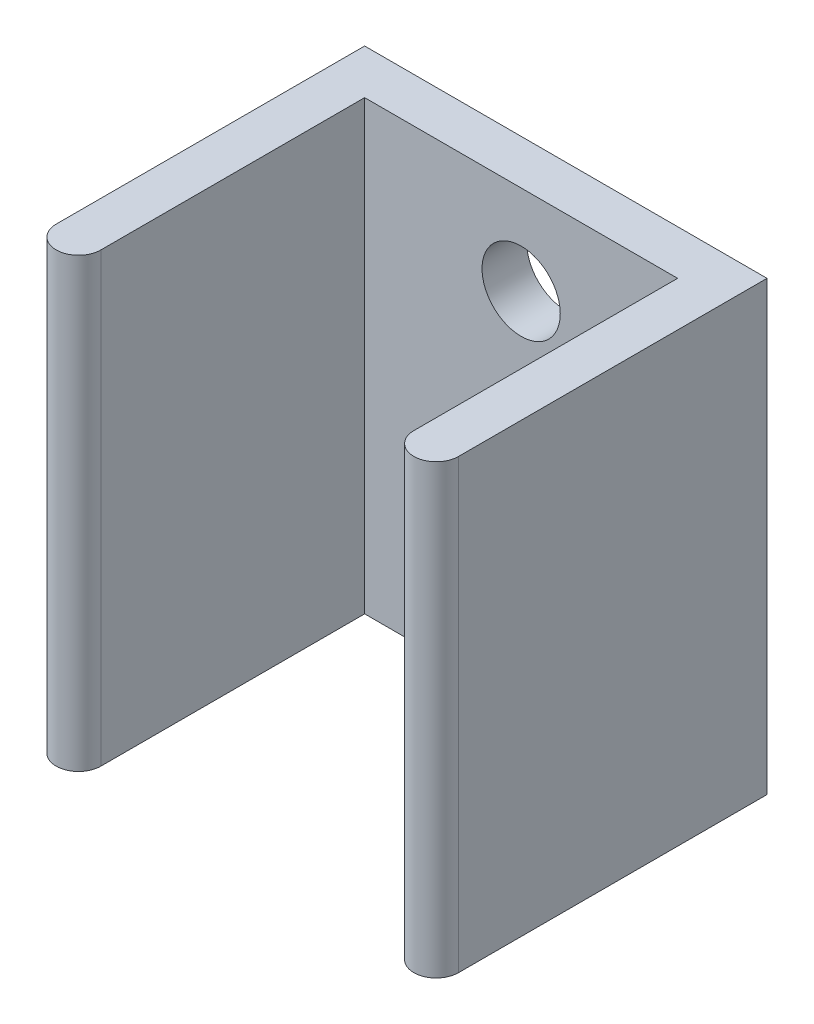
ISO-10303-21;
HEADER;
FILE_DESCRIPTION(('STEP AP214'),'2;1');
FILE_NAME('part.step','',(''),(''),'','','');
FILE_SCHEMA(('AUTOMOTIVE_DESIGN { 1 0 10303 214 1 1 1 1 }'));
ENDSEC;
DATA;
#1=APPLICATION_CONTEXT('core data for automotive mechanical design processes');
#2=APPLICATION_PROTOCOL_DEFINITION('international standard','automotive_design',2000,#1);
#3=PRODUCT_CONTEXT('',#1,'mechanical');
#4=PRODUCT('Part','Part','',(#3));
#5=PRODUCT_RELATED_PRODUCT_CATEGORY('part','',(#4));
#6=PRODUCT_DEFINITION_FORMATION('','',#4);
#7=PRODUCT_DEFINITION_CONTEXT('part definition',#1,'design');
#8=PRODUCT_DEFINITION('design','',#6,#7);
#9=PRODUCT_DEFINITION_SHAPE('','',#8);
#10=(LENGTH_UNIT() NAMED_UNIT(*) SI_UNIT(.MILLI.,.METRE.));
#11=(NAMED_UNIT(*) PLANE_ANGLE_UNIT() SI_UNIT($,.RADIAN.));
#12=(NAMED_UNIT(*) SI_UNIT($,.STERADIAN.) SOLID_ANGLE_UNIT());
#13=UNCERTAINTY_MEASURE_WITH_UNIT(LENGTH_MEASURE(1.E-05),#10,'distance_accuracy_value','');
#14=(GEOMETRIC_REPRESENTATION_CONTEXT(3) GLOBAL_UNCERTAINTY_ASSIGNED_CONTEXT((#13)) GLOBAL_UNIT_ASSIGNED_CONTEXT((#10,
#11,#12)) REPRESENTATION_CONTEXT('',''));
#15=CARTESIAN_POINT('',(0.,0.,0.));
#16=DIRECTION('',(0.,0.,1.));
#17=DIRECTION('',(1.,0.,0.));
#18=AXIS2_PLACEMENT_3D('',#15,#16,#17);
#19=CARTESIAN_POINT('',(8.00000000000001,-10.,13.8));
#20=DIRECTION('',(0.,-1.,0.));
#21=DIRECTION('',(1.,0.,0.));
#22=AXIS2_PLACEMENT_3D('',#19,#20,#21);
#23=CYLINDRICAL_SURFACE('',#22,0.999999999999999);
#24=DIRECTION('',(0.,-1.,0.));
#25=VECTOR('',#24,1.);
#26=CARTESIAN_POINT('',(7.00000000000001,9.99999999999998,13.8));
#27=LINE('',#26,#25);
#28=CARTESIAN_POINT('',(7.00000000000001,-10.,13.8));
#29=VERTEX_POINT('',#28);
#30=CARTESIAN_POINT('',(7.00000000000001,9.99999999999998,13.8));
#31=VERTEX_POINT('',#30);
#32=EDGE_CURVE('E157',#29,#31,#27,.F.);
#33=ORIENTED_EDGE('',*,*,#32,.F.);
#34=CARTESIAN_POINT('',(8.00000000000001,-10.,13.8));
#35=DIRECTION('',(0.,1.,0.));
#36=DIRECTION('',(0.,0.,1.));
#37=AXIS2_PLACEMENT_3D('',#34,#35,#36);
#38=CIRCLE('',#37,0.999999999999999);
#39=CARTESIAN_POINT('',(9.00000000000001,-10.,13.8));
#40=VERTEX_POINT('',#39);
#41=EDGE_CURVE('E43',#40,#29,#38,.F.);
#42=ORIENTED_EDGE('',*,*,#41,.F.);
#43=DIRECTION('',(0.,-1.,0.));
#44=VECTOR('',#43,1.);
#45=CARTESIAN_POINT('',(9.00000000000001,9.99999999999998,13.8));
#46=LINE('',#45,#44);
#47=CARTESIAN_POINT('',(9.00000000000001,9.99999999999998,13.8));
#48=VERTEX_POINT('',#47);
#49=EDGE_CURVE('E160',#48,#40,#46,.T.);
#50=ORIENTED_EDGE('',*,*,#49,.F.);
#51=CARTESIAN_POINT('',(8.00000000000001,9.99999999999998,13.8));
#52=DIRECTION('',(0.,-1.,0.));
#53=DIRECTION('',(0.,0.,-1.));
#54=AXIS2_PLACEMENT_3D('',#51,#52,#53);
#55=CIRCLE('',#54,0.999999999999999);
#56=EDGE_CURVE('E11',#31,#48,#55,.F.);
#57=ORIENTED_EDGE('',*,*,#56,.F.);
#58=EDGE_LOOP('',(#33,#42,#50,#57));
#59=FACE_BOUND('',#58,.T.);
#60=ADVANCED_FACE('F35',(#59),#23,.T.);
#61=CARTESIAN_POINT('',(-7.99999999999999,-10.,13.8));
#62=DIRECTION('',(0.,-1.,0.));
#63=DIRECTION('',(0.,0.,-1.));
#64=AXIS2_PLACEMENT_3D('',#61,#62,#63);
#65=CYLINDRICAL_SURFACE('',#64,1.);
#66=DIRECTION('',(0.,1.,0.));
#67=VECTOR('',#66,1.);
#68=CARTESIAN_POINT('',(-8.99999999999999,-10.,13.8));
#69=LINE('',#68,#67);
#70=CARTESIAN_POINT('',(-8.99999999999999,-10.,13.8));
#71=VERTEX_POINT('',#70);
#72=CARTESIAN_POINT('',(-8.99999999999999,9.99999999999998,13.8));
#73=VERTEX_POINT('',#72);
#74=EDGE_CURVE('E149',#71,#73,#69,.T.);
#75=ORIENTED_EDGE('',*,*,#74,.F.);
#76=CARTESIAN_POINT('',(-7.99999999999999,-10.,13.8));
#77=DIRECTION('',(0.,1.,0.));
#78=DIRECTION('',(0.,0.,1.));
#79=AXIS2_PLACEMENT_3D('',#76,#77,#78);
#80=CIRCLE('',#79,1.);
#81=CARTESIAN_POINT('',(-6.99999999999999,-10.,13.8));
#82=VERTEX_POINT('',#81);
#83=EDGE_CURVE('E154',#82,#71,#80,.F.);
#84=ORIENTED_EDGE('',*,*,#83,.F.);
#85=DIRECTION('',(0.,1.,0.));
#86=VECTOR('',#85,1.);
#87=CARTESIAN_POINT('',(-6.99999999999999,-10.,13.8));
#88=LINE('',#87,#86);
#89=CARTESIAN_POINT('',(-6.99999999999999,9.99999999999998,13.8));
#90=VERTEX_POINT('',#89);
#91=EDGE_CURVE('E152',#90,#82,#88,.F.);
#92=ORIENTED_EDGE('',*,*,#91,.F.);
#93=CARTESIAN_POINT('',(-7.99999999999999,9.99999999999998,13.8));
#94=DIRECTION('',(0.,-1.,0.));
#95=DIRECTION('',(0.,0.,-1.));
#96=AXIS2_PLACEMENT_3D('',#93,#94,#95);
#97=CIRCLE('',#96,1.);
#98=EDGE_CURVE('E101',#73,#90,#97,.F.);
#99=ORIENTED_EDGE('',*,*,#98,.F.);
#100=EDGE_LOOP('',(#75,#84,#92,#99));
#101=FACE_BOUND('',#100,.T.);
#102=ADVANCED_FACE('F195',(#101),#65,.T.);
#103=CARTESIAN_POINT('',(0.,0.,2.));
#104=DIRECTION('',(0.,0.,1.));
#105=DIRECTION('',(1.,0.,0.));
#106=AXIS2_PLACEMENT_3D('',#103,#104,#105);
#107=PLANE('',#106);
#108=CARTESIAN_POINT('',(0.,5.99999999999998,2.));
#109=DIRECTION('',(0.,0.,1.));
#110=DIRECTION('',(1.,0.,0.));
#111=AXIS2_PLACEMENT_3D('',#108,#109,#110);
#112=CIRCLE('',#111,1.75);
#113=CARTESIAN_POINT('',(1.75,5.99999999999998,2.));
#114=VERTEX_POINT('',#113);
#115=EDGE_CURVE('E176',#114,#114,#112,.T.);
#116=ORIENTED_EDGE('',*,*,#115,.F.);
#117=EDGE_LOOP('',(#116));
#118=FACE_BOUND('',#117,.T.);
#119=CARTESIAN_POINT('',(0.,-6.00000000000002,2.));
#120=DIRECTION('',(0.,0.,1.));
#121=DIRECTION('',(1.,0.,0.));
#122=AXIS2_PLACEMENT_3D('',#119,#120,#121);
#123=CIRCLE('',#122,1.75);
#124=CARTESIAN_POINT('',(1.75,-6.00000000000002,2.));
#125=VERTEX_POINT('',#124);
#126=EDGE_CURVE('E170',#125,#125,#123,.T.);
#127=ORIENTED_EDGE('',*,*,#126,.F.);
#128=EDGE_LOOP('',(#127));
#129=FACE_BOUND('',#128,.T.);
#130=DIRECTION('',(1.,0.,0.));
#131=VECTOR('',#130,1.);
#132=CARTESIAN_POINT('',(-8.99999999999999,-10.,2.));
#133=LINE('',#132,#131);
#134=CARTESIAN_POINT('',(-6.99999999999999,-10.,2.));
#135=VERTEX_POINT('',#134);
#136=CARTESIAN_POINT('',(7.00000000000001,-10.,2.));
#137=VERTEX_POINT('',#136);
#138=EDGE_CURVE('E117',#135,#137,#133,.T.);
#139=ORIENTED_EDGE('',*,*,#138,.T.);
#140=DIRECTION('',(0.,-1.,0.));
#141=VECTOR('',#140,1.);
#142=CARTESIAN_POINT('',(7.00000000000001,9.99999999999998,2.));
#143=LINE('',#142,#141);
#144=CARTESIAN_POINT('',(7.00000000000001,9.99999999999998,2.));
#145=VERTEX_POINT('',#144);
#146=EDGE_CURVE('E116',#145,#137,#143,.T.);
#147=ORIENTED_EDGE('',*,*,#146,.F.);
#148=DIRECTION('',(-1.,0.,0.));
#149=VECTOR('',#148,1.);
#150=CARTESIAN_POINT('',(-8.99999999999999,9.99999999999998,2.));
#151=LINE('',#150,#149);
#152=CARTESIAN_POINT('',(-6.99999999999999,9.99999999999998,2.));
#153=VERTEX_POINT('',#152);
#154=EDGE_CURVE('E99',#145,#153,#151,.T.);
#155=ORIENTED_EDGE('',*,*,#154,.T.);
#156=DIRECTION('',(0.,1.,0.));
#157=VECTOR('',#156,1.);
#158=CARTESIAN_POINT('',(-6.99999999999999,9.99999999999998,2.));
#159=LINE('',#158,#157);
#160=EDGE_CURVE('E107',#135,#153,#159,.T.);
#161=ORIENTED_EDGE('',*,*,#160,.F.);
#162=EDGE_LOOP('',(#139,#147,#155,#161));
#163=FACE_BOUND('',#162,.T.);
#164=ADVANCED_FACE('F113',(#118,#129,#163),#107,.T.);
#165=CARTESIAN_POINT('',(9.00000000000001,9.99999999999998,2.));
#166=DIRECTION('',(-1.,0.,0.));
#167=DIRECTION('',(0.,-1.,0.));
#168=AXIS2_PLACEMENT_3D('',#165,#166,#167);
#169=PLANE('',#168);
#170=DIRECTION('',(0.,0.,-1.));
#171=VECTOR('',#170,1.);
#172=CARTESIAN_POINT('',(9.00000000000001,9.99999999999998,2.));
#173=LINE('',#172,#171);
#174=CARTESIAN_POINT('',(9.00000000000001,9.99999999999998,0.));
#175=VERTEX_POINT('',#174);
#176=EDGE_CURVE('E147',#48,#175,#173,.T.);
#177=ORIENTED_EDGE('',*,*,#176,.F.);
#178=ORIENTED_EDGE('',*,*,#49,.T.);
#179=DIRECTION('',(0.,0.,-1.));
#180=VECTOR('',#179,1.);
#181=CARTESIAN_POINT('',(9.00000000000001,-10.,2.));
#182=LINE('',#181,#180);
#183=CARTESIAN_POINT('',(9.00000000000001,-10.,0.));
#184=VERTEX_POINT('',#183);
#185=EDGE_CURVE('E131',#40,#184,#182,.T.);
#186=ORIENTED_EDGE('',*,*,#185,.T.);
#187=DIRECTION('',(0.,1.,0.));
#188=VECTOR('',#187,1.);
#189=CARTESIAN_POINT('',(9.00000000000001,9.99999999999998,0.));
#190=LINE('',#189,#188);
#191=EDGE_CURVE('E128',#184,#175,#190,.T.);
#192=ORIENTED_EDGE('',*,*,#191,.T.);
#193=EDGE_LOOP('',(#177,#178,#186,#192));
#194=FACE_BOUND('',#193,.T.);
#195=ADVANCED_FACE('F194',(#194),#169,.F.);
#196=CARTESIAN_POINT('',(-8.99999999999999,9.99999999999998,2.));
#197=DIRECTION('',(0.,-1.,0.));
#198=DIRECTION('',(0.,0.,-1.));
#199=AXIS2_PLACEMENT_3D('',#196,#197,#198);
#200=PLANE('',#199);
#201=DIRECTION('',(0.,0.,-1.));
#202=VECTOR('',#201,1.);
#203=CARTESIAN_POINT('',(7.00000000000001,9.99999999999998,14.8));
#204=LINE('',#203,#202);
#205=EDGE_CURVE('E122',#31,#145,#204,.T.);
#206=ORIENTED_EDGE('',*,*,#205,.F.);
#207=ORIENTED_EDGE('',*,*,#56,.T.);
#208=ORIENTED_EDGE('',*,*,#176,.T.);
#209=DIRECTION('',(-1.,0.,0.));
#210=VECTOR('',#209,1.);
#211=CARTESIAN_POINT('',(-8.99999999999999,9.99999999999998,0.));
#212=LINE('',#211,#210);
#213=CARTESIAN_POINT('',(-8.99999999999999,9.99999999999998,0.));
#214=VERTEX_POINT('',#213);
#215=EDGE_CURVE('E134',#175,#214,#212,.T.);
#216=ORIENTED_EDGE('',*,*,#215,.T.);
#217=DIRECTION('',(0.,0.,-1.));
#218=VECTOR('',#217,1.);
#219=CARTESIAN_POINT('',(-8.99999999999999,9.99999999999998,2.));
#220=LINE('',#219,#218);
#221=EDGE_CURVE('E145',#73,#214,#220,.T.);
#222=ORIENTED_EDGE('',*,*,#221,.F.);
#223=ORIENTED_EDGE('',*,*,#98,.T.);
#224=DIRECTION('',(0.,0.,-1.));
#225=VECTOR('',#224,1.);
#226=CARTESIAN_POINT('',(-6.99999999999999,9.99999999999998,14.8));
#227=LINE('',#226,#225);
#228=EDGE_CURVE('E96',#90,#153,#227,.T.);
#229=ORIENTED_EDGE('',*,*,#228,.T.);
#230=ORIENTED_EDGE('',*,*,#154,.F.);
#231=EDGE_LOOP('',(#206,#207,#208,#216,#222,#223,#229,#230));
#232=FACE_BOUND('',#231,.T.);
#233=ADVANCED_FACE('F98',(#232),#200,.F.);
#234=CARTESIAN_POINT('',(-8.99999999999999,9.99999999999998,2.));
#235=DIRECTION('',(1.,0.,0.));
#236=DIRECTION('',(0.,1.,0.));
#237=AXIS2_PLACEMENT_3D('',#234,#235,#236);
#238=PLANE('',#237);
#239=DIRECTION('',(0.,0.,-1.));
#240=VECTOR('',#239,1.);
#241=CARTESIAN_POINT('',(-8.99999999999999,-10.,2.));
#242=LINE('',#241,#240);
#243=CARTESIAN_POINT('',(-8.99999999999999,-10.,0.));
#244=VERTEX_POINT('',#243);
#245=EDGE_CURVE('E143',#71,#244,#242,.T.);
#246=ORIENTED_EDGE('',*,*,#245,.F.);
#247=ORIENTED_EDGE('',*,*,#74,.T.);
#248=ORIENTED_EDGE('',*,*,#221,.T.);
#249=DIRECTION('',(0.,-1.,0.));
#250=VECTOR('',#249,1.);
#251=CARTESIAN_POINT('',(-8.99999999999999,9.99999999999998,0.));
#252=LINE('',#251,#250);
#253=EDGE_CURVE('E137',#214,#244,#252,.T.);
#254=ORIENTED_EDGE('',*,*,#253,.T.);
#255=EDGE_LOOP('',(#246,#247,#248,#254));
#256=FACE_BOUND('',#255,.T.);
#257=ADVANCED_FACE('F224',(#256),#238,.F.);
#258=CARTESIAN_POINT('',(-8.99999999999999,-10.,2.));
#259=DIRECTION('',(0.,1.,0.));
#260=DIRECTION('',(0.,0.,1.));
#261=AXIS2_PLACEMENT_3D('',#258,#259,#260);
#262=PLANE('',#261);
#263=ORIENTED_EDGE('',*,*,#185,.F.);
#264=ORIENTED_EDGE('',*,*,#41,.T.);
#265=DIRECTION('',(0.,0.,-1.));
#266=VECTOR('',#265,1.);
#267=CARTESIAN_POINT('',(7.00000000000001,-10.,14.8));
#268=LINE('',#267,#266);
#269=EDGE_CURVE('E124',#29,#137,#268,.T.);
#270=ORIENTED_EDGE('',*,*,#269,.T.);
#271=ORIENTED_EDGE('',*,*,#138,.F.);
#272=DIRECTION('',(0.,0.,-1.));
#273=VECTOR('',#272,1.);
#274=CARTESIAN_POINT('',(-6.99999999999999,-10.,14.8));
#275=LINE('',#274,#273);
#276=EDGE_CURVE('E106',#82,#135,#275,.T.);
#277=ORIENTED_EDGE('',*,*,#276,.F.);
#278=ORIENTED_EDGE('',*,*,#83,.T.);
#279=ORIENTED_EDGE('',*,*,#245,.T.);
#280=DIRECTION('',(1.,0.,0.));
#281=VECTOR('',#280,1.);
#282=CARTESIAN_POINT('',(-8.99999999999999,-10.,0.));
#283=LINE('',#282,#281);
#284=EDGE_CURVE('E118',#244,#184,#283,.T.);
#285=ORIENTED_EDGE('',*,*,#284,.T.);
#286=EDGE_LOOP('',(#263,#264,#270,#271,#277,#278,#279,#285));
#287=FACE_BOUND('',#286,.T.);
#288=ADVANCED_FACE('F163',(#287),#262,.F.);
#289=CARTESIAN_POINT('',(0.,0.,0.));
#290=DIRECTION('',(0.,0.,1.));
#291=DIRECTION('',(1.,0.,0.));
#292=AXIS2_PLACEMENT_3D('',#289,#290,#291);
#293=PLANE('',#292);
#294=CARTESIAN_POINT('',(0.,5.99999999999998,0.));
#295=DIRECTION('',(0.,0.,1.));
#296=DIRECTION('',(1.,0.,0.));
#297=AXIS2_PLACEMENT_3D('',#294,#295,#296);
#298=CIRCLE('',#297,1.75);
#299=CARTESIAN_POINT('',(1.75,5.99999999999998,0.));
#300=VERTEX_POINT('',#299);
#301=EDGE_CURVE('E173',#300,#300,#298,.T.);
#302=ORIENTED_EDGE('',*,*,#301,.T.);
#303=EDGE_LOOP('',(#302));
#304=FACE_BOUND('',#303,.T.);
#305=CARTESIAN_POINT('',(0.,-6.00000000000002,0.));
#306=DIRECTION('',(0.,0.,1.));
#307=DIRECTION('',(1.,0.,0.));
#308=AXIS2_PLACEMENT_3D('',#305,#306,#307);
#309=CIRCLE('',#308,1.75);
#310=CARTESIAN_POINT('',(1.75,-6.00000000000002,0.));
#311=VERTEX_POINT('',#310);
#312=EDGE_CURVE('E167',#311,#311,#309,.T.);
#313=ORIENTED_EDGE('',*,*,#312,.T.);
#314=EDGE_LOOP('',(#313));
#315=FACE_BOUND('',#314,.T.);
#316=ORIENTED_EDGE('',*,*,#191,.F.);
#317=ORIENTED_EDGE('',*,*,#284,.F.);
#318=ORIENTED_EDGE('',*,*,#253,.F.);
#319=ORIENTED_EDGE('',*,*,#215,.F.);
#320=EDGE_LOOP('',(#316,#317,#318,#319));
#321=FACE_BOUND('',#320,.T.);
#322=ADVANCED_FACE('F182',(#304,#315,#321),#293,.F.);
#323=CARTESIAN_POINT('',(-6.99999999999999,9.99999999999998,14.8));
#324=DIRECTION('',(-1.,0.,0.));
#325=DIRECTION('',(0.,-1.,0.));
#326=AXIS2_PLACEMENT_3D('',#323,#324,#325);
#327=PLANE('',#326);
#328=ORIENTED_EDGE('',*,*,#228,.F.);
#329=ORIENTED_EDGE('',*,*,#91,.T.);
#330=ORIENTED_EDGE('',*,*,#276,.T.);
#331=ORIENTED_EDGE('',*,*,#160,.T.);
#332=EDGE_LOOP('',(#328,#329,#330,#331));
#333=FACE_BOUND('',#332,.T.);
#334=ADVANCED_FACE('F120',(#333),#327,.F.);
#335=CARTESIAN_POINT('',(7.00000000000001,9.99999999999998,14.8));
#336=DIRECTION('',(1.,0.,0.));
#337=DIRECTION('',(0.,1.,0.));
#338=AXIS2_PLACEMENT_3D('',#335,#336,#337);
#339=PLANE('',#338);
#340=ORIENTED_EDGE('',*,*,#269,.F.);
#341=ORIENTED_EDGE('',*,*,#32,.T.);
#342=ORIENTED_EDGE('',*,*,#205,.T.);
#343=ORIENTED_EDGE('',*,*,#146,.T.);
#344=EDGE_LOOP('',(#340,#341,#342,#343));
#345=FACE_BOUND('',#344,.T.);
#346=ADVANCED_FACE('F166',(#345),#339,.F.);
#347=CARTESIAN_POINT('',(0.,-6.00000000000002,0.));
#348=DIRECTION('',(0.,0.,1.));
#349=DIRECTION('',(1.,0.,0.));
#350=AXIS2_PLACEMENT_3D('',#347,#348,#349);
#351=CYLINDRICAL_SURFACE('',#350,1.75);
#352=ORIENTED_EDGE('',*,*,#312,.F.);
#353=EDGE_LOOP('',(#352));
#354=FACE_BOUND('',#353,.T.);
#355=ORIENTED_EDGE('',*,*,#126,.T.);
#356=EDGE_LOOP('',(#355));
#357=FACE_BOUND('',#356,.T.);
#358=ADVANCED_FACE('F188',(#354,#357),#351,.F.);
#359=CARTESIAN_POINT('',(0.,5.99999999999998,0.));
#360=DIRECTION('',(0.,0.,1.));
#361=DIRECTION('',(1.,0.,0.));
#362=AXIS2_PLACEMENT_3D('',#359,#360,#361);
#363=CYLINDRICAL_SURFACE('',#362,1.75);
#364=ORIENTED_EDGE('',*,*,#301,.F.);
#365=EDGE_LOOP('',(#364));
#366=FACE_BOUND('',#365,.T.);
#367=ORIENTED_EDGE('',*,*,#115,.T.);
#368=EDGE_LOOP('',(#367));
#369=FACE_BOUND('',#368,.T.);
#370=ADVANCED_FACE('F185',(#366,#369),#363,.F.);
#371=CLOSED_SHELL('',(#60,#102,#164,#195,#233,#257,#288,#322,#334,#346,#358,#370));
#372=MANIFOLD_SOLID_BREP('B2',#371);
#373=ADVANCED_BREP_SHAPE_REPRESENTATION('',(#18,#372),#14);
#374=SHAPE_DEFINITION_REPRESENTATION(#9,#373);
ENDSEC;
END-ISO-10303-21;
